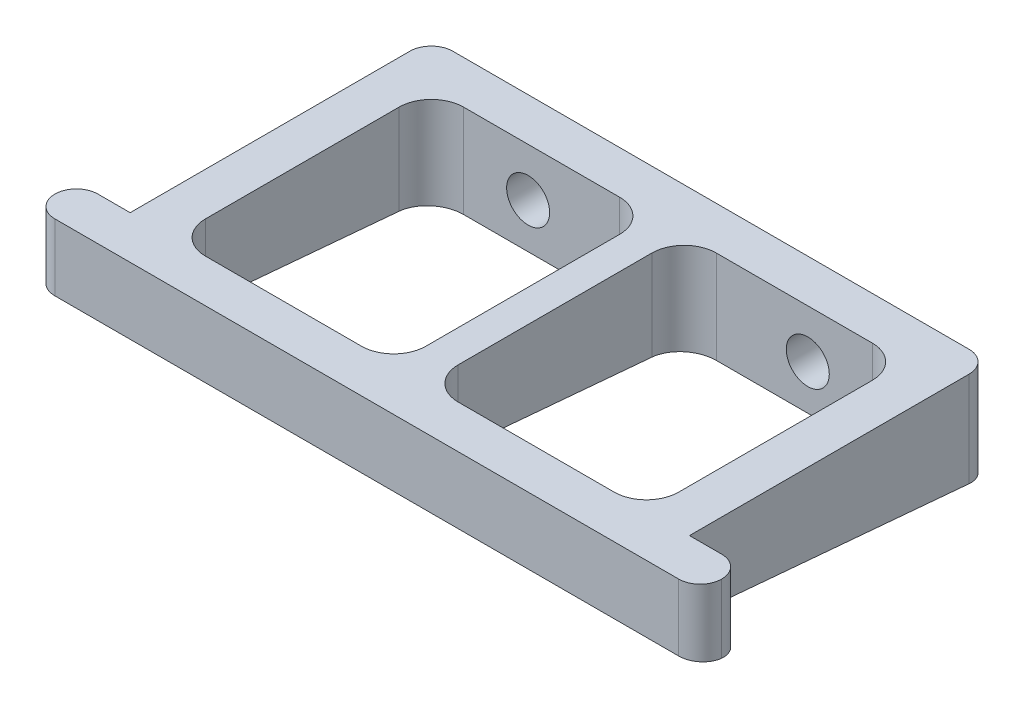
ISO-10303-21;
HEADER;
FILE_DESCRIPTION(('STEP AP214'),'2;1');
FILE_NAME('part.step','',(''),(''),'','','');
FILE_SCHEMA(('AUTOMOTIVE_DESIGN { 1 0 10303 214 1 1 1 1 }'));
ENDSEC;
DATA;
#1=APPLICATION_CONTEXT('core data for automotive mechanical design processes');
#2=APPLICATION_PROTOCOL_DEFINITION('international standard','automotive_design',2000,#1);
#3=PRODUCT_CONTEXT('',#1,'mechanical');
#4=PRODUCT('Part','Part','',(#3));
#5=PRODUCT_RELATED_PRODUCT_CATEGORY('part','',(#4));
#6=PRODUCT_DEFINITION_FORMATION('','',#4);
#7=PRODUCT_DEFINITION_CONTEXT('part definition',#1,'design');
#8=PRODUCT_DEFINITION('design','',#6,#7);
#9=PRODUCT_DEFINITION_SHAPE('','',#8);
#10=(LENGTH_UNIT() NAMED_UNIT(*) SI_UNIT(.MILLI.,.METRE.));
#11=(NAMED_UNIT(*) PLANE_ANGLE_UNIT() SI_UNIT($,.RADIAN.));
#12=(NAMED_UNIT(*) SI_UNIT($,.STERADIAN.) SOLID_ANGLE_UNIT());
#13=UNCERTAINTY_MEASURE_WITH_UNIT(LENGTH_MEASURE(1.E-05),#10,'distance_accuracy_value','');
#14=(GEOMETRIC_REPRESENTATION_CONTEXT(3) GLOBAL_UNCERTAINTY_ASSIGNED_CONTEXT((#13)) GLOBAL_UNIT_ASSIGNED_CONTEXT((#10,
#11,#12)) REPRESENTATION_CONTEXT('',''));
#15=CARTESIAN_POINT('',(0.,0.,0.));
#16=DIRECTION('',(0.,0.,1.));
#17=DIRECTION('',(1.,0.,0.));
#18=AXIS2_PLACEMENT_3D('',#15,#16,#17);
#19=CARTESIAN_POINT('',(0.,9.,0.));
#20=DIRECTION('',(0.,1.,0.));
#21=DIRECTION('',(0.,0.,1.));
#22=AXIS2_PLACEMENT_3D('',#19,#20,#21);
#23=PLANE('',#22);
#24=DIRECTION('',(-1.,0.,0.));
#25=VECTOR('',#24,1.);
#26=CARTESIAN_POINT('',(-26.,9.,-16.));
#27=LINE('',#26,#25);
#28=CARTESIAN_POINT('',(24.,9.,-16.));
#29=VERTEX_POINT('',#28);
#30=CARTESIAN_POINT('',(-24.,9.,-16.));
#31=VERTEX_POINT('',#30);
#32=EDGE_CURVE('E242',#29,#31,#27,.T.);
#33=ORIENTED_EDGE('',*,*,#32,.T.);
#34=CARTESIAN_POINT('',(-24.,9.,-14.));
#35=DIRECTION('',(0.,1.,0.));
#36=DIRECTION('',(0.,0.,1.));
#37=AXIS2_PLACEMENT_3D('',#34,#35,#36);
#38=CIRCLE('',#37,2.);
#39=CARTESIAN_POINT('',(-26.,9.,-14.));
#40=VERTEX_POINT('',#39);
#41=EDGE_CURVE('E232',#31,#40,#38,.T.);
#42=ORIENTED_EDGE('',*,*,#41,.T.);
#43=DIRECTION('',(0.,0.,1.));
#44=VECTOR('',#43,1.);
#45=CARTESIAN_POINT('',(-26.,9.,-16.));
#46=LINE('',#45,#44);
#47=CARTESIAN_POINT('',(-26.,9.,12.));
#48=VERTEX_POINT('',#47);
#49=EDGE_CURVE('E471',#40,#48,#46,.T.);
#50=ORIENTED_EDGE('',*,*,#49,.T.);
#51=DIRECTION('',(-1.,0.,0.));
#52=VECTOR('',#51,1.);
#53=CARTESIAN_POINT('',(-31.,9.,12.));
#54=LINE('',#53,#52);
#55=CARTESIAN_POINT('',(-29.,9.,12.));
#56=VERTEX_POINT('',#55);
#57=EDGE_CURVE('E420',#48,#56,#54,.T.);
#58=ORIENTED_EDGE('',*,*,#57,.T.);
#59=CARTESIAN_POINT('',(-29.,9.,14.));
#60=DIRECTION('',(0.,1.,0.));
#61=DIRECTION('',(0.,0.,1.));
#62=AXIS2_PLACEMENT_3D('',#59,#60,#61);
#63=CIRCLE('',#62,2.);
#64=CARTESIAN_POINT('',(-31.,9.,14.));
#65=VERTEX_POINT('',#64);
#66=EDGE_CURVE('E54',#56,#65,#63,.T.);
#67=ORIENTED_EDGE('',*,*,#66,.T.);
#68=CARTESIAN_POINT('',(-29.,9.,14.));
#69=DIRECTION('',(0.,1.,0.));
#70=DIRECTION('',(0.,0.,1.));
#71=AXIS2_PLACEMENT_3D('',#68,#69,#70);
#72=CIRCLE('',#71,2.);
#73=CARTESIAN_POINT('',(-29.,9.,16.));
#74=VERTEX_POINT('',#73);
#75=EDGE_CURVE('E395',#65,#74,#72,.T.);
#76=ORIENTED_EDGE('',*,*,#75,.T.);
#77=DIRECTION('',(1.,0.,0.));
#78=VECTOR('',#77,1.);
#79=CARTESIAN_POINT('',(26.,9.,16.));
#80=LINE('',#79,#78);
#81=CARTESIAN_POINT('',(29.,9.,16.));
#82=VERTEX_POINT('',#81);
#83=EDGE_CURVE('E310',#74,#82,#80,.T.);
#84=ORIENTED_EDGE('',*,*,#83,.T.);
#85=CARTESIAN_POINT('',(29.,9.,14.));
#86=DIRECTION('',(0.,1.,0.));
#87=DIRECTION('',(0.,0.,1.));
#88=AXIS2_PLACEMENT_3D('',#85,#86,#87);
#89=CIRCLE('',#88,2.);
#90=CARTESIAN_POINT('',(31.,9.,14.));
#91=VERTEX_POINT('',#90);
#92=EDGE_CURVE('E248',#82,#91,#89,.T.);
#93=ORIENTED_EDGE('',*,*,#92,.T.);
#94=CARTESIAN_POINT('',(29.,9.,14.));
#95=DIRECTION('',(0.,1.,0.));
#96=DIRECTION('',(0.,0.,1.));
#97=AXIS2_PLACEMENT_3D('',#94,#95,#96);
#98=CIRCLE('',#97,2.);
#99=CARTESIAN_POINT('',(29.,9.,12.));
#100=VERTEX_POINT('',#99);
#101=EDGE_CURVE('E251',#91,#100,#98,.T.);
#102=ORIENTED_EDGE('',*,*,#101,.T.);
#103=DIRECTION('',(-1.,0.,0.));
#104=VECTOR('',#103,1.);
#105=CARTESIAN_POINT('',(31.,9.,12.));
#106=LINE('',#105,#104);
#107=CARTESIAN_POINT('',(26.,9.,12.));
#108=VERTEX_POINT('',#107);
#109=EDGE_CURVE('E240',#100,#108,#106,.T.);
#110=ORIENTED_EDGE('',*,*,#109,.T.);
#111=DIRECTION('',(0.,0.,-1.));
#112=VECTOR('',#111,1.);
#113=CARTESIAN_POINT('',(26.,9.,-16.));
#114=LINE('',#113,#112);
#115=CARTESIAN_POINT('',(26.,9.,-14.));
#116=VERTEX_POINT('',#115);
#117=EDGE_CURVE('E226',#108,#116,#114,.T.);
#118=ORIENTED_EDGE('',*,*,#117,.T.);
#119=CARTESIAN_POINT('',(24.,9.,-14.));
#120=DIRECTION('',(0.,1.,0.));
#121=DIRECTION('',(0.,0.,1.));
#122=AXIS2_PLACEMENT_3D('',#119,#120,#121);
#123=CIRCLE('',#122,2.);
#124=EDGE_CURVE('E237',#116,#29,#123,.T.);
#125=ORIENTED_EDGE('',*,*,#124,.T.);
#126=EDGE_LOOP('',(#33,#42,#50,#58,#67,#76,#84,#93,#102,#110,#118,#125));
#127=FACE_BOUND('',#126,.T.);
#128=DIRECTION('',(-1.,0.,0.));
#129=VECTOR('',#128,1.);
#130=CARTESIAN_POINT('',(-22.,9.,-12.));
#131=LINE('',#130,#129);
#132=CARTESIAN_POINT('',(-4.5,9.,-12.));
#133=VERTEX_POINT('',#132);
#134=CARTESIAN_POINT('',(-19.,9.,-12.));
#135=VERTEX_POINT('',#134);
#136=EDGE_CURVE('E461',#133,#135,#131,.T.);
#137=ORIENTED_EDGE('',*,*,#136,.F.);
#138=CARTESIAN_POINT('',(-4.5,9.,-9.));
#139=DIRECTION('',(0.,1.,0.));
#140=DIRECTION('',(0.,0.,1.));
#141=AXIS2_PLACEMENT_3D('',#138,#139,#140);
#142=CIRCLE('',#141,3.);
#143=CARTESIAN_POINT('',(-1.5,9.,-9.));
#144=VERTEX_POINT('',#143);
#145=EDGE_CURVE('E289',#133,#144,#142,.F.);
#146=ORIENTED_EDGE('',*,*,#145,.T.);
#147=DIRECTION('',(0.,0.,-1.));
#148=VECTOR('',#147,1.);
#149=CARTESIAN_POINT('',(-1.5,9.,-12.));
#150=LINE('',#149,#148);
#151=CARTESIAN_POINT('',(-1.5,9.,9.));
#152=VERTEX_POINT('',#151);
#153=EDGE_CURVE('E271',#152,#144,#150,.T.);
#154=ORIENTED_EDGE('',*,*,#153,.F.);
#155=CARTESIAN_POINT('',(-4.5,9.,9.));
#156=DIRECTION('',(0.,1.,0.));
#157=DIRECTION('',(0.,0.,1.));
#158=AXIS2_PLACEMENT_3D('',#155,#156,#157);
#159=CIRCLE('',#158,3.);
#160=CARTESIAN_POINT('',(-4.5,9.,12.));
#161=VERTEX_POINT('',#160);
#162=EDGE_CURVE('E276',#152,#161,#159,.F.);
#163=ORIENTED_EDGE('',*,*,#162,.T.);
#164=DIRECTION('',(1.,0.,0.));
#165=VECTOR('',#164,1.);
#166=CARTESIAN_POINT('',(-22.,9.,12.));
#167=LINE('',#166,#165);
#168=CARTESIAN_POINT('',(-19.,9.,12.));
#169=VERTEX_POINT('',#168);
#170=EDGE_CURVE('E317',#169,#161,#167,.T.);
#171=ORIENTED_EDGE('',*,*,#170,.F.);
#172=CARTESIAN_POINT('',(-19.,9.,9.));
#173=DIRECTION('',(0.,1.,0.));
#174=DIRECTION('',(0.,0.,1.));
#175=AXIS2_PLACEMENT_3D('',#172,#173,#174);
#176=CIRCLE('',#175,3.);
#177=CARTESIAN_POINT('',(-22.,9.,9.));
#178=VERTEX_POINT('',#177);
#179=EDGE_CURVE('E275',#169,#178,#176,.F.);
#180=ORIENTED_EDGE('',*,*,#179,.T.);
#181=DIRECTION('',(0.,0.,1.));
#182=VECTOR('',#181,1.);
#183=CARTESIAN_POINT('',(-22.,9.,-12.));
#184=LINE('',#183,#182);
#185=CARTESIAN_POINT('',(-22.,9.,-9.));
#186=VERTEX_POINT('',#185);
#187=EDGE_CURVE('E464',#186,#178,#184,.T.);
#188=ORIENTED_EDGE('',*,*,#187,.F.);
#189=CARTESIAN_POINT('',(-19.,9.,-9.));
#190=DIRECTION('',(0.,1.,0.));
#191=DIRECTION('',(0.,0.,1.));
#192=AXIS2_PLACEMENT_3D('',#189,#190,#191);
#193=CIRCLE('',#192,3.);
#194=EDGE_CURVE('E282',#186,#135,#193,.F.);
#195=ORIENTED_EDGE('',*,*,#194,.T.);
#196=EDGE_LOOP('',(#137,#146,#154,#163,#171,#180,#188,#195));
#197=FACE_BOUND('',#196,.T.);
#198=DIRECTION('',(-1.,0.,0.));
#199=VECTOR('',#198,1.);
#200=CARTESIAN_POINT('',(22.,9.,-12.));
#201=LINE('',#200,#199);
#202=CARTESIAN_POINT('',(19.,9.,-12.));
#203=VERTEX_POINT('',#202);
#204=CARTESIAN_POINT('',(4.5,9.,-12.));
#205=VERTEX_POINT('',#204);
#206=EDGE_CURVE('E452',#203,#205,#201,.T.);
#207=ORIENTED_EDGE('',*,*,#206,.F.);
#208=CARTESIAN_POINT('',(19.,9.,-9.00000000000001));
#209=DIRECTION('',(0.,1.,0.));
#210=DIRECTION('',(0.,0.,1.));
#211=AXIS2_PLACEMENT_3D('',#208,#209,#210);
#212=CIRCLE('',#211,3.);
#213=CARTESIAN_POINT('',(22.,9.,-9.00000000000001));
#214=VERTEX_POINT('',#213);
#215=EDGE_CURVE('E335',#203,#214,#212,.F.);
#216=ORIENTED_EDGE('',*,*,#215,.T.);
#217=DIRECTION('',(0.,0.,-1.));
#218=VECTOR('',#217,1.);
#219=CARTESIAN_POINT('',(22.,9.,-12.));
#220=LINE('',#219,#218);
#221=CARTESIAN_POINT('',(22.,9.,8.99999999999999));
#222=VERTEX_POINT('',#221);
#223=EDGE_CURVE('E324',#222,#214,#220,.T.);
#224=ORIENTED_EDGE('',*,*,#223,.F.);
#225=CARTESIAN_POINT('',(19.,9.,8.99999999999999));
#226=DIRECTION('',(0.,1.,0.));
#227=DIRECTION('',(0.,0.,1.));
#228=AXIS2_PLACEMENT_3D('',#225,#226,#227);
#229=CIRCLE('',#228,3.);
#230=CARTESIAN_POINT('',(19.,9.,12.));
#231=VERTEX_POINT('',#230);
#232=EDGE_CURVE('E166',#222,#231,#229,.F.);
#233=ORIENTED_EDGE('',*,*,#232,.T.);
#234=DIRECTION('',(1.,0.,0.));
#235=VECTOR('',#234,1.);
#236=CARTESIAN_POINT('',(22.,9.,12.));
#237=LINE('',#236,#235);
#238=CARTESIAN_POINT('',(4.50000000000001,9.,12.));
#239=VERTEX_POINT('',#238);
#240=EDGE_CURVE('E292',#239,#231,#237,.T.);
#241=ORIENTED_EDGE('',*,*,#240,.F.);
#242=CARTESIAN_POINT('',(4.50000000000001,9.,9.));
#243=DIRECTION('',(0.,1.,0.));
#244=DIRECTION('',(0.,0.,1.));
#245=AXIS2_PLACEMENT_3D('',#242,#243,#244);
#246=CIRCLE('',#245,3.);
#247=CARTESIAN_POINT('',(1.50000000000001,9.,9.));
#248=VERTEX_POINT('',#247);
#249=EDGE_CURVE('E328',#239,#248,#246,.F.);
#250=ORIENTED_EDGE('',*,*,#249,.T.);
#251=DIRECTION('',(0.,0.,1.));
#252=VECTOR('',#251,1.);
#253=CARTESIAN_POINT('',(1.5,9.,-12.));
#254=LINE('',#253,#252);
#255=CARTESIAN_POINT('',(1.5,9.,-9.));
#256=VERTEX_POINT('',#255);
#257=EDGE_CURVE('E436',#256,#248,#254,.T.);
#258=ORIENTED_EDGE('',*,*,#257,.F.);
#259=CARTESIAN_POINT('',(4.5,9.,-9.));
#260=DIRECTION('',(0.,1.,0.));
#261=DIRECTION('',(0.,0.,1.));
#262=AXIS2_PLACEMENT_3D('',#259,#260,#261);
#263=CIRCLE('',#262,3.);
#264=EDGE_CURVE('E283',#256,#205,#263,.F.);
#265=ORIENTED_EDGE('',*,*,#264,.T.);
#266=EDGE_LOOP('',(#207,#216,#224,#233,#241,#250,#258,#265));
#267=FACE_BOUND('',#266,.T.);
#268=ADVANCED_FACE('F35',(#127,#197,#267),#23,.T.);
#269=CARTESIAN_POINT('',(-26.,0.,-16.));
#270=DIRECTION('',(0.,-0.996194698091745,0.0871557427476582));
#271=DIRECTION('',(0.,-0.0871557427476582,-0.996194698091746));
#272=AXIS2_PLACEMENT_3D('',#269,#270,#271);
#273=PLANE('',#272);
#274=DIRECTION('',(-1.,0.,0.));
#275=VECTOR('',#274,1.);
#276=CARTESIAN_POINT('',(-22.,2.44968257872587,12.));
#277=LINE('',#276,#275);
#278=CARTESIAN_POINT('',(-19.,2.44968257872587,12.));
#279=VERTEX_POINT('',#278);
#280=CARTESIAN_POINT('',(-4.5,2.44968257872587,12.));
#281=VERTEX_POINT('',#280);
#282=EDGE_CURVE('E268',#279,#281,#277,.F.);
#283=ORIENTED_EDGE('',*,*,#282,.T.);
#284=CARTESIAN_POINT('',(-4.5,2.1872165881481,9.));
#285=DIRECTION('',(0.,-0.996194698091745,0.0871557427476582));
#286=DIRECTION('',(0.,0.0871557427476582,0.996194698091746));
#287=AXIS2_PLACEMENT_3D('',#284,#285,#286);
#288=ELLIPSE('',#287,3.01145951263004,3.);
#289=CARTESIAN_POINT('',(-1.5,2.1872165881481,9.));
#290=VERTEX_POINT('',#289);
#291=EDGE_CURVE('E293',#281,#290,#288,.F.);
#292=ORIENTED_EDGE('',*,*,#291,.T.);
#293=DIRECTION('',(0.,0.0871557427476582,0.996194698091746));
#294=VECTOR('',#293,1.);
#295=CARTESIAN_POINT('',(-1.5,0.415661466778926,-11.2489676944744));
#296=LINE('',#295,#294);
#297=CARTESIAN_POINT('',(-1.5,0.612420644681469,-9.));
#298=VERTEX_POINT('',#297);
#299=EDGE_CURVE('E286',#290,#298,#296,.F.);
#300=ORIENTED_EDGE('',*,*,#299,.T.);
#301=CARTESIAN_POINT('',(-4.5,0.612420644681469,-9.));
#302=DIRECTION('',(0.,-0.996194698091745,0.0871557427476582));
#303=DIRECTION('',(0.,0.0871557427476582,0.996194698091746));
#304=AXIS2_PLACEMENT_3D('',#301,#302,#303);
#305=ELLIPSE('',#304,3.01145951263004,3.);
#306=CARTESIAN_POINT('',(-4.5,0.349954654103698,-12.));
#307=VERTEX_POINT('',#306);
#308=EDGE_CURVE('E287',#298,#307,#305,.F.);
#309=ORIENTED_EDGE('',*,*,#308,.T.);
#310=DIRECTION('',(1.,0.,0.));
#311=VECTOR('',#310,1.);
#312=CARTESIAN_POINT('',(-22.,0.349954654103698,-12.));
#313=LINE('',#312,#311);
#314=CARTESIAN_POINT('',(-19.,0.349954654103696,-12.));
#315=VERTEX_POINT('',#314);
#316=EDGE_CURVE('E279',#307,#315,#313,.F.);
#317=ORIENTED_EDGE('',*,*,#316,.T.);
#318=CARTESIAN_POINT('',(-19.,0.612420644681469,-9.));
#319=DIRECTION('',(0.,-0.996194698091745,0.0871557427476582));
#320=DIRECTION('',(0.,0.0871557427476582,0.996194698091746));
#321=AXIS2_PLACEMENT_3D('',#318,#319,#320);
#322=ELLIPSE('',#321,3.01145951263004,3.);
#323=CARTESIAN_POINT('',(-22.,0.612420644681469,-9.));
#324=VERTEX_POINT('',#323);
#325=EDGE_CURVE('E280',#315,#324,#322,.F.);
#326=ORIENTED_EDGE('',*,*,#325,.T.);
#327=DIRECTION('',(0.,-0.0871557427476582,-0.996194698091746));
#328=VECTOR('',#327,1.);
#329=CARTESIAN_POINT('',(-22.,0.415661466778926,-11.2489676944744));
#330=LINE('',#329,#328);
#331=CARTESIAN_POINT('',(-22.,2.1872165881481,9.));
#332=VERTEX_POINT('',#331);
#333=EDGE_CURVE('E272',#324,#332,#330,.F.);
#334=ORIENTED_EDGE('',*,*,#333,.T.);
#335=CARTESIAN_POINT('',(-19.,2.1872165881481,9.));
#336=DIRECTION('',(0.,-0.996194698091745,0.0871557427476582));
#337=DIRECTION('',(0.,0.0871557427476582,0.996194698091746));
#338=AXIS2_PLACEMENT_3D('',#335,#336,#337);
#339=ELLIPSE('',#338,3.01145951263004,3.);
#340=EDGE_CURVE('E273',#332,#279,#339,.F.);
#341=ORIENTED_EDGE('',*,*,#340,.T.);
#342=EDGE_LOOP('',(#283,#292,#300,#309,#317,#326,#334,#341));
#343=FACE_BOUND('',#342,.T.);
#344=DIRECTION('',(0.,-0.0871557427476582,-0.996194698091746));
#345=VECTOR('',#344,1.);
#346=CARTESIAN_POINT('',(-26.,0.068365111445064,-15.2185832004988));
#347=LINE('',#346,#345);
#348=CARTESIAN_POINT('',(-26.,0.174977327051847,-14.));
#349=VERTEX_POINT('',#348);
#350=CARTESIAN_POINT('',(-26.,2.44968257872587,12.));
#351=VERTEX_POINT('',#350);
#352=EDGE_CURVE('E295',#349,#351,#347,.F.);
#353=ORIENTED_EDGE('',*,*,#352,.F.);
#354=CARTESIAN_POINT('',(-24.,0.174977327051847,-14.));
#355=DIRECTION('',(0.,-0.996194698091745,0.0871557427476582));
#356=DIRECTION('',(0.,-0.0871557427476582,-0.996194698091746));
#357=AXIS2_PLACEMENT_3D('',#354,#355,#356);
#358=ELLIPSE('',#357,2.0076396750867,2.);
#359=CARTESIAN_POINT('',(-24.,0.,-16.));
#360=VERTEX_POINT('',#359);
#361=EDGE_CURVE('E320',#349,#360,#358,.T.);
#362=ORIENTED_EDGE('',*,*,#361,.T.);
#363=DIRECTION('',(-1.,0.,0.));
#364=VECTOR('',#363,1.);
#365=CARTESIAN_POINT('',(-26.,0.,-16.));
#366=LINE('',#365,#364);
#367=CARTESIAN_POINT('',(24.,0.,-16.));
#368=VERTEX_POINT('',#367);
#369=EDGE_CURVE('E298',#368,#360,#366,.T.);
#370=ORIENTED_EDGE('',*,*,#369,.F.);
#371=CARTESIAN_POINT('',(24.,0.174977327051847,-14.));
#372=DIRECTION('',(0.,-0.996194698091745,0.0871557427476582));
#373=DIRECTION('',(0.,-0.0871557427476582,-0.996194698091746));
#374=AXIS2_PLACEMENT_3D('',#371,#372,#373);
#375=ELLIPSE('',#374,2.0076396750867,2.);
#376=CARTESIAN_POINT('',(26.,0.174977327051847,-14.));
#377=VERTEX_POINT('',#376);
#378=EDGE_CURVE('E313',#368,#377,#375,.T.);
#379=ORIENTED_EDGE('',*,*,#378,.T.);
#380=DIRECTION('',(0.,0.0871557427476582,0.996194698091746));
#381=VECTOR('',#380,1.);
#382=CARTESIAN_POINT('',(26.,0.068365111445064,-15.2185832004988));
#383=LINE('',#382,#381);
#384=CARTESIAN_POINT('',(26.,2.44968257872587,12.));
#385=VERTEX_POINT('',#384);
#386=EDGE_CURVE('E228',#385,#377,#383,.F.);
#387=ORIENTED_EDGE('',*,*,#386,.F.);
#388=DIRECTION('',(1.,0.,0.));
#389=VECTOR('',#388,1.);
#390=CARTESIAN_POINT('',(31.,2.44968257872587,12.));
#391=LINE('',#390,#389);
#392=CARTESIAN_POINT('',(29.,2.44968257872587,12.));
#393=VERTEX_POINT('',#392);
#394=EDGE_CURVE('E315',#393,#385,#391,.F.);
#395=ORIENTED_EDGE('',*,*,#394,.F.);
#396=CARTESIAN_POINT('',(29.,2.62465990577772,14.));
#397=DIRECTION('',(0.,-0.996194698091745,0.0871557427476582));
#398=DIRECTION('',(0.,-0.0871557427476582,-0.996194698091746));
#399=AXIS2_PLACEMENT_3D('',#396,#397,#398);
#400=ELLIPSE('',#399,2.0076396750867,2.);
#401=CARTESIAN_POINT('',(31.,2.62465990577772,14.));
#402=VERTEX_POINT('',#401);
#403=EDGE_CURVE('E304',#393,#402,#400,.T.);
#404=ORIENTED_EDGE('',*,*,#403,.T.);
#405=CARTESIAN_POINT('',(29.,2.62465990577772,14.));
#406=DIRECTION('',(0.,-0.996194698091745,0.0871557427476582));
#407=DIRECTION('',(0.,-0.0871557427476582,-0.996194698091746));
#408=AXIS2_PLACEMENT_3D('',#405,#406,#407);
#409=ELLIPSE('',#408,2.0076396750867,2.);
#410=CARTESIAN_POINT('',(29.,2.79963723282957,16.));
#411=VERTEX_POINT('',#410);
#412=EDGE_CURVE('E311',#402,#411,#409,.T.);
#413=ORIENTED_EDGE('',*,*,#412,.T.);
#414=DIRECTION('',(-1.,0.,0.));
#415=VECTOR('',#414,1.);
#416=CARTESIAN_POINT('',(-26.,2.79963723282957,16.));
#417=LINE('',#416,#415);
#418=CARTESIAN_POINT('',(-29.,2.79963723282957,16.));
#419=VERTEX_POINT('',#418);
#420=EDGE_CURVE('E301',#419,#411,#417,.F.);
#421=ORIENTED_EDGE('',*,*,#420,.F.);
#422=CARTESIAN_POINT('',(-29.,2.62465990577772,14.));
#423=DIRECTION('',(0.,-0.996194698091745,0.0871557427476582));
#424=DIRECTION('',(0.,-0.0871557427476582,-0.996194698091746));
#425=AXIS2_PLACEMENT_3D('',#422,#423,#424);
#426=ELLIPSE('',#425,2.0076396750867,2.);
#427=CARTESIAN_POINT('',(-31.,2.62465990577772,14.));
#428=VERTEX_POINT('',#427);
#429=EDGE_CURVE('E305',#419,#428,#426,.T.);
#430=ORIENTED_EDGE('',*,*,#429,.T.);
#431=CARTESIAN_POINT('',(-29.,2.62465990577772,14.));
#432=DIRECTION('',(0.,-0.996194698091745,0.0871557427476582));
#433=DIRECTION('',(0.,-0.0871557427476582,-0.996194698091746));
#434=AXIS2_PLACEMENT_3D('',#431,#432,#433);
#435=ELLIPSE('',#434,2.0076396750867,2.);
#436=CARTESIAN_POINT('',(-29.,2.44968257872587,12.));
#437=VERTEX_POINT('',#436);
#438=EDGE_CURVE('E302',#428,#437,#435,.T.);
#439=ORIENTED_EDGE('',*,*,#438,.T.);
#440=DIRECTION('',(1.,0.,0.));
#441=VECTOR('',#440,1.);
#442=CARTESIAN_POINT('',(-31.,2.44968257872587,12.));
#443=LINE('',#442,#441);
#444=EDGE_CURVE('E297',#351,#437,#443,.F.);
#445=ORIENTED_EDGE('',*,*,#444,.F.);
#446=EDGE_LOOP('',(#353,#362,#370,#379,#387,#395,#404,#413,#421,#430,#439,#445));
#447=FACE_BOUND('',#446,.T.);
#448=DIRECTION('',(-1.,0.,0.));
#449=VECTOR('',#448,1.);
#450=CARTESIAN_POINT('',(22.,2.44968257872587,12.));
#451=LINE('',#450,#449);
#452=CARTESIAN_POINT('',(4.50000000000001,2.44968257872587,12.));
#453=VERTEX_POINT('',#452);
#454=CARTESIAN_POINT('',(19.,2.44968257872587,12.));
#455=VERTEX_POINT('',#454);
#456=EDGE_CURVE('E322',#453,#455,#451,.F.);
#457=ORIENTED_EDGE('',*,*,#456,.T.);
#458=CARTESIAN_POINT('',(19.,2.1872165881481,8.99999999999999));
#459=DIRECTION('',(0.,-0.996194698091745,0.0871557427476582));
#460=DIRECTION('',(0.,0.0871557427476582,0.996194698091746));
#461=AXIS2_PLACEMENT_3D('',#458,#459,#460);
#462=ELLIPSE('',#461,3.01145951263004,3.);
#463=CARTESIAN_POINT('',(22.,2.1872165881481,8.99999999999999));
#464=VERTEX_POINT('',#463);
#465=EDGE_CURVE('E39',#455,#464,#462,.F.);
#466=ORIENTED_EDGE('',*,*,#465,.T.);
#467=DIRECTION('',(0.,0.0871557427476582,0.996194698091746));
#468=VECTOR('',#467,1.);
#469=CARTESIAN_POINT('',(22.,0.415661466778926,-11.2489676944744));
#470=LINE('',#469,#468);
#471=CARTESIAN_POINT('',(22.,0.612420644681468,-9.00000000000001));
#472=VERTEX_POINT('',#471);
#473=EDGE_CURVE('E263',#464,#472,#470,.F.);
#474=ORIENTED_EDGE('',*,*,#473,.T.);
#475=CARTESIAN_POINT('',(19.,0.612420644681469,-9.00000000000001));
#476=DIRECTION('',(0.,-0.996194698091745,0.0871557427476582));
#477=DIRECTION('',(0.,0.0871557427476582,0.996194698091746));
#478=AXIS2_PLACEMENT_3D('',#475,#476,#477);
#479=ELLIPSE('',#478,3.01145951263004,3.);
#480=CARTESIAN_POINT('',(19.,0.349954654103698,-12.));
#481=VERTEX_POINT('',#480);
#482=EDGE_CURVE('E338',#472,#481,#479,.F.);
#483=ORIENTED_EDGE('',*,*,#482,.T.);
#484=DIRECTION('',(1.,0.,0.));
#485=VECTOR('',#484,1.);
#486=CARTESIAN_POINT('',(22.,0.349954654103698,-12.));
#487=LINE('',#486,#485);
#488=CARTESIAN_POINT('',(4.5,0.349954654103696,-12.));
#489=VERTEX_POINT('',#488);
#490=EDGE_CURVE('E332',#481,#489,#487,.F.);
#491=ORIENTED_EDGE('',*,*,#490,.T.);
#492=CARTESIAN_POINT('',(4.5,0.612420644681469,-9.));
#493=DIRECTION('',(0.,-0.996194698091745,0.0871557427476582));
#494=DIRECTION('',(0.,0.0871557427476582,0.996194698091746));
#495=AXIS2_PLACEMENT_3D('',#492,#493,#494);
#496=ELLIPSE('',#495,3.01145951263004,3.);
#497=CARTESIAN_POINT('',(1.5,0.612420644681469,-9.));
#498=VERTEX_POINT('',#497);
#499=EDGE_CURVE('E333',#489,#498,#496,.F.);
#500=ORIENTED_EDGE('',*,*,#499,.T.);
#501=DIRECTION('',(0.,-0.0871557427476582,-0.996194698091746));
#502=VECTOR('',#501,1.);
#503=CARTESIAN_POINT('',(1.5,0.415661466778926,-11.2489676944744));
#504=LINE('',#503,#502);
#505=CARTESIAN_POINT('',(1.50000000000001,2.1872165881481,9.));
#506=VERTEX_POINT('',#505);
#507=EDGE_CURVE('E325',#498,#506,#504,.F.);
#508=ORIENTED_EDGE('',*,*,#507,.T.);
#509=CARTESIAN_POINT('',(4.50000000000001,2.1872165881481,9.));
#510=DIRECTION('',(0.,-0.996194698091745,0.0871557427476582));
#511=DIRECTION('',(0.,0.0871557427476582,0.996194698091746));
#512=AXIS2_PLACEMENT_3D('',#509,#510,#511);
#513=ELLIPSE('',#512,3.01145951263004,3.);
#514=EDGE_CURVE('E326',#506,#453,#513,.F.);
#515=ORIENTED_EDGE('',*,*,#514,.T.);
#516=EDGE_LOOP('',(#457,#466,#474,#483,#491,#500,#508,#515));
#517=FACE_BOUND('',#516,.T.);
#518=ADVANCED_FACE('F37',(#343,#447,#517),#273,.T.);
#519=CARTESIAN_POINT('',(31.,9.,12.));
#520=DIRECTION('',(0.,0.,1.));
#521=DIRECTION('',(1.,0.,0.));
#522=AXIS2_PLACEMENT_3D('',#519,#520,#521);
#523=PLANE('',#522);
#524=ORIENTED_EDGE('',*,*,#109,.F.);
#525=DIRECTION('',(0.,-1.,0.));
#526=VECTOR('',#525,1.);
#527=CARTESIAN_POINT('',(29.,9.,12.));
#528=LINE('',#527,#526);
#529=EDGE_CURVE('E45',#100,#393,#528,.T.);
#530=ORIENTED_EDGE('',*,*,#529,.T.);
#531=ORIENTED_EDGE('',*,*,#394,.T.);
#532=DIRECTION('',(0.,-1.,0.));
#533=VECTOR('',#532,1.);
#534=CARTESIAN_POINT('',(26.,9.,12.));
#535=LINE('',#534,#533);
#536=EDGE_CURVE('E405',#108,#385,#535,.T.);
#537=ORIENTED_EDGE('',*,*,#536,.F.);
#538=EDGE_LOOP('',(#524,#530,#531,#537));
#539=FACE_BOUND('',#538,.T.);
#540=ADVANCED_FACE('F403',(#539),#523,.F.);
#541=CARTESIAN_POINT('',(26.,9.,-16.));
#542=DIRECTION('',(-1.,0.,0.));
#543=DIRECTION('',(0.,0.,1.));
#544=AXIS2_PLACEMENT_3D('',#541,#542,#543);
#545=PLANE('',#544);
#546=ORIENTED_EDGE('',*,*,#386,.T.);
#547=DIRECTION('',(0.,-1.,0.));
#548=VECTOR('',#547,1.);
#549=CARTESIAN_POINT('',(26.,9.,-14.));
#550=LINE('',#549,#548);
#551=EDGE_CURVE('E222',#377,#116,#550,.F.);
#552=ORIENTED_EDGE('',*,*,#551,.T.);
#553=ORIENTED_EDGE('',*,*,#117,.F.);
#554=ORIENTED_EDGE('',*,*,#536,.T.);
#555=EDGE_LOOP('',(#546,#552,#553,#554));
#556=FACE_BOUND('',#555,.T.);
#557=ADVANCED_FACE('F224',(#556),#545,.F.);
#558=CARTESIAN_POINT('',(-26.,9.,-16.));
#559=DIRECTION('',(0.,0.,1.));
#560=DIRECTION('',(1.,0.,0.));
#561=AXIS2_PLACEMENT_3D('',#558,#559,#560);
#562=PLANE('',#561);
#563=CARTESIAN_POINT('',(-13.,4.49999999999999,-16.));
#564=DIRECTION('',(0.,0.,-1.));
#565=DIRECTION('',(1.,0.,0.));
#566=AXIS2_PLACEMENT_3D('',#563,#564,#565);
#567=CIRCLE('',#566,2.);
#568=CARTESIAN_POINT('',(-11.,4.49999999999999,-16.));
#569=VERTEX_POINT('',#568);
#570=EDGE_CURVE('E782',#569,#569,#567,.T.);
#571=ORIENTED_EDGE('',*,*,#570,.F.);
#572=EDGE_LOOP('',(#571));
#573=FACE_BOUND('',#572,.T.);
#574=CARTESIAN_POINT('',(13.,4.5,-16.));
#575=DIRECTION('',(0.,0.,-1.));
#576=DIRECTION('',(-1.,0.,0.));
#577=AXIS2_PLACEMENT_3D('',#574,#575,#576);
#578=CIRCLE('',#577,2.);
#579=CARTESIAN_POINT('',(11.,4.5,-16.));
#580=VERTEX_POINT('',#579);
#581=EDGE_CURVE('E267',#580,#580,#578,.T.);
#582=ORIENTED_EDGE('',*,*,#581,.F.);
#583=EDGE_LOOP('',(#582));
#584=FACE_BOUND('',#583,.T.);
#585=ORIENTED_EDGE('',*,*,#369,.T.);
#586=DIRECTION('',(0.,-1.,0.));
#587=VECTOR('',#586,1.);
#588=CARTESIAN_POINT('',(-24.,9.,-16.));
#589=LINE('',#588,#587);
#590=EDGE_CURVE('E393',#360,#31,#589,.F.);
#591=ORIENTED_EDGE('',*,*,#590,.T.);
#592=ORIENTED_EDGE('',*,*,#32,.F.);
#593=DIRECTION('',(0.,-1.,0.));
#594=VECTOR('',#593,1.);
#595=CARTESIAN_POINT('',(24.,9.,-16.));
#596=LINE('',#595,#594);
#597=EDGE_CURVE('E247',#29,#368,#596,.T.);
#598=ORIENTED_EDGE('',*,*,#597,.T.);
#599=EDGE_LOOP('',(#585,#591,#592,#598));
#600=FACE_BOUND('',#599,.T.);
#601=ADVANCED_FACE('F478',(#573,#584,#600),#562,.F.);
#602=CARTESIAN_POINT('',(-26.,9.,-16.));
#603=DIRECTION('',(1.,0.,0.));
#604=DIRECTION('',(0.,0.,-1.));
#605=AXIS2_PLACEMENT_3D('',#602,#603,#604);
#606=PLANE('',#605);
#607=ORIENTED_EDGE('',*,*,#49,.F.);
#608=DIRECTION('',(0.,-1.,0.));
#609=VECTOR('',#608,1.);
#610=CARTESIAN_POINT('',(-26.,9.,-14.));
#611=LINE('',#610,#609);
#612=EDGE_CURVE('E307',#40,#349,#611,.T.);
#613=ORIENTED_EDGE('',*,*,#612,.T.);
#614=ORIENTED_EDGE('',*,*,#352,.T.);
#615=DIRECTION('',(0.,-1.,0.));
#616=VECTOR('',#615,1.);
#617=CARTESIAN_POINT('',(-26.,9.,12.));
#618=LINE('',#617,#616);
#619=EDGE_CURVE('E414',#48,#351,#618,.T.);
#620=ORIENTED_EDGE('',*,*,#619,.F.);
#621=EDGE_LOOP('',(#607,#613,#614,#620));
#622=FACE_BOUND('',#621,.T.);
#623=ADVANCED_FACE('F486',(#622),#606,.F.);
#624=CARTESIAN_POINT('',(-31.,9.,12.));
#625=DIRECTION('',(0.,0.,1.));
#626=DIRECTION('',(1.,0.,0.));
#627=AXIS2_PLACEMENT_3D('',#624,#625,#626);
#628=PLANE('',#627);
#629=ORIENTED_EDGE('',*,*,#444,.T.);
#630=DIRECTION('',(0.,-1.,0.));
#631=VECTOR('',#630,1.);
#632=CARTESIAN_POINT('',(-29.,9.,12.));
#633=LINE('',#632,#631);
#634=EDGE_CURVE('E11',#437,#56,#633,.F.);
#635=ORIENTED_EDGE('',*,*,#634,.T.);
#636=ORIENTED_EDGE('',*,*,#57,.F.);
#637=ORIENTED_EDGE('',*,*,#619,.T.);
#638=EDGE_LOOP('',(#629,#635,#636,#637));
#639=FACE_BOUND('',#638,.T.);
#640=ADVANCED_FACE('F491',(#639),#628,.F.);
#641=CARTESIAN_POINT('',(-26.,9.,16.));
#642=DIRECTION('',(0.,0.,-1.));
#643=DIRECTION('',(-1.,0.,0.));
#644=AXIS2_PLACEMENT_3D('',#641,#642,#643);
#645=PLANE('',#644);
#646=ORIENTED_EDGE('',*,*,#420,.T.);
#647=DIRECTION('',(0.,-1.,0.));
#648=VECTOR('',#647,1.);
#649=CARTESIAN_POINT('',(29.,9.,16.));
#650=LINE('',#649,#648);
#651=EDGE_CURVE('E256',#411,#82,#650,.F.);
#652=ORIENTED_EDGE('',*,*,#651,.T.);
#653=ORIENTED_EDGE('',*,*,#83,.F.);
#654=DIRECTION('',(0.,-1.,0.));
#655=VECTOR('',#654,1.);
#656=CARTESIAN_POINT('',(-29.,9.,16.));
#657=LINE('',#656,#655);
#658=EDGE_CURVE('E231',#74,#419,#657,.T.);
#659=ORIENTED_EDGE('',*,*,#658,.T.);
#660=EDGE_LOOP('',(#646,#652,#653,#659));
#661=FACE_BOUND('',#660,.T.);
#662=ADVANCED_FACE('F503',(#661),#645,.F.);
#663=CARTESIAN_POINT('',(-1.5,9.,-12.));
#664=DIRECTION('',(-1.,0.,0.));
#665=DIRECTION('',(0.,0.,1.));
#666=AXIS2_PLACEMENT_3D('',#663,#664,#665);
#667=PLANE('',#666);
#668=ORIENTED_EDGE('',*,*,#153,.T.);
#669=DIRECTION('',(0.,-1.,0.));
#670=VECTOR('',#669,1.);
#671=CARTESIAN_POINT('',(-1.5,0.,-9.));
#672=LINE('',#671,#670);
#673=EDGE_CURVE('E374',#144,#298,#672,.T.);
#674=ORIENTED_EDGE('',*,*,#673,.T.);
#675=ORIENTED_EDGE('',*,*,#299,.F.);
#676=DIRECTION('',(0.,-1.,0.));
#677=VECTOR('',#676,1.);
#678=CARTESIAN_POINT('',(-1.5,9.,9.));
#679=LINE('',#678,#677);
#680=EDGE_CURVE('E372',#290,#152,#679,.F.);
#681=ORIENTED_EDGE('',*,*,#680,.T.);
#682=EDGE_LOOP('',(#668,#674,#675,#681));
#683=FACE_BOUND('',#682,.T.);
#684=ADVANCED_FACE('F523',(#683),#667,.T.);
#685=CARTESIAN_POINT('',(-22.,9.,-12.));
#686=DIRECTION('',(0.,0.,1.));
#687=DIRECTION('',(1.,0.,0.));
#688=AXIS2_PLACEMENT_3D('',#685,#686,#687);
#689=PLANE('',#688);
#690=CARTESIAN_POINT('',(-13.,4.49999999999999,-12.));
#691=DIRECTION('',(0.,0.,1.));
#692=DIRECTION('',(1.,0.,0.));
#693=AXIS2_PLACEMENT_3D('',#690,#691,#692);
#694=CIRCLE('',#693,2.);
#695=CARTESIAN_POINT('',(-11.,4.49999999999999,-12.));
#696=VERTEX_POINT('',#695);
#697=EDGE_CURVE('E786',#696,#696,#694,.F.);
#698=ORIENTED_EDGE('',*,*,#697,.T.);
#699=EDGE_LOOP('',(#698));
#700=FACE_BOUND('',#699,.T.);
#701=ORIENTED_EDGE('',*,*,#136,.T.);
#702=DIRECTION('',(0.,-1.,0.));
#703=VECTOR('',#702,1.);
#704=CARTESIAN_POINT('',(-19.,0.,-12.));
#705=LINE('',#704,#703);
#706=EDGE_CURVE('E364',#135,#315,#705,.T.);
#707=ORIENTED_EDGE('',*,*,#706,.T.);
#708=ORIENTED_EDGE('',*,*,#316,.F.);
#709=DIRECTION('',(0.,-1.,0.));
#710=VECTOR('',#709,1.);
#711=CARTESIAN_POINT('',(-4.5,9.,-12.));
#712=LINE('',#711,#710);
#713=EDGE_CURVE('E362',#307,#133,#712,.F.);
#714=ORIENTED_EDGE('',*,*,#713,.T.);
#715=EDGE_LOOP('',(#701,#707,#708,#714));
#716=FACE_BOUND('',#715,.T.);
#717=ADVANCED_FACE('F660',(#700,#716),#689,.T.);
#718=CARTESIAN_POINT('',(-22.,9.,-12.));
#719=DIRECTION('',(1.,0.,0.));
#720=DIRECTION('',(0.,0.,-1.));
#721=AXIS2_PLACEMENT_3D('',#718,#719,#720);
#722=PLANE('',#721);
#723=ORIENTED_EDGE('',*,*,#333,.F.);
#724=DIRECTION('',(0.,-1.,0.));
#725=VECTOR('',#724,1.);
#726=CARTESIAN_POINT('',(-22.,9.,-9.));
#727=LINE('',#726,#725);
#728=EDGE_CURVE('E370',#324,#186,#727,.F.);
#729=ORIENTED_EDGE('',*,*,#728,.T.);
#730=ORIENTED_EDGE('',*,*,#187,.T.);
#731=DIRECTION('',(0.,-1.,0.));
#732=VECTOR('',#731,1.);
#733=CARTESIAN_POINT('',(-22.,0.,9.));
#734=LINE('',#733,#732);
#735=EDGE_CURVE('E367',#178,#332,#734,.T.);
#736=ORIENTED_EDGE('',*,*,#735,.T.);
#737=EDGE_LOOP('',(#723,#729,#730,#736));
#738=FACE_BOUND('',#737,.T.);
#739=ADVANCED_FACE('F669',(#738),#722,.T.);
#740=CARTESIAN_POINT('',(-22.,9.,12.));
#741=DIRECTION('',(0.,0.,-1.));
#742=DIRECTION('',(-1.,0.,0.));
#743=AXIS2_PLACEMENT_3D('',#740,#741,#742);
#744=PLANE('',#743);
#745=ORIENTED_EDGE('',*,*,#170,.T.);
#746=DIRECTION('',(0.,-1.,0.));
#747=VECTOR('',#746,1.);
#748=CARTESIAN_POINT('',(-4.5,0.,12.));
#749=LINE('',#748,#747);
#750=EDGE_CURVE('E329',#161,#281,#749,.T.);
#751=ORIENTED_EDGE('',*,*,#750,.T.);
#752=ORIENTED_EDGE('',*,*,#282,.F.);
#753=DIRECTION('',(0.,-1.,0.));
#754=VECTOR('',#753,1.);
#755=CARTESIAN_POINT('',(-19.,9.,12.));
#756=LINE('',#755,#754);
#757=EDGE_CURVE('E377',#279,#169,#756,.F.);
#758=ORIENTED_EDGE('',*,*,#757,.T.);
#759=EDGE_LOOP('',(#745,#751,#752,#758));
#760=FACE_BOUND('',#759,.T.);
#761=ADVANCED_FACE('F678',(#760),#744,.T.);
#762=CARTESIAN_POINT('',(22.,9.,-12.));
#763=DIRECTION('',(-1.,0.,0.));
#764=DIRECTION('',(0.,0.,1.));
#765=AXIS2_PLACEMENT_3D('',#762,#763,#764);
#766=PLANE('',#765);
#767=ORIENTED_EDGE('',*,*,#473,.F.);
#768=DIRECTION('',(0.,-1.,0.));
#769=VECTOR('',#768,1.);
#770=CARTESIAN_POINT('',(22.,9.,8.99999999999999));
#771=LINE('',#770,#769);
#772=EDGE_CURVE('E345',#464,#222,#771,.F.);
#773=ORIENTED_EDGE('',*,*,#772,.T.);
#774=ORIENTED_EDGE('',*,*,#223,.T.);
#775=DIRECTION('',(0.,-1.,0.));
#776=VECTOR('',#775,1.);
#777=CARTESIAN_POINT('',(22.,0.,-9.00000000000001));
#778=LINE('',#777,#776);
#779=EDGE_CURVE('E347',#214,#472,#778,.T.);
#780=ORIENTED_EDGE('',*,*,#779,.T.);
#781=EDGE_LOOP('',(#767,#773,#774,#780));
#782=FACE_BOUND('',#781,.T.);
#783=ADVANCED_FACE('F343',(#782),#766,.T.);
#784=CARTESIAN_POINT('',(22.,9.,-12.));
#785=DIRECTION('',(0.,0.,1.));
#786=DIRECTION('',(1.,0.,0.));
#787=AXIS2_PLACEMENT_3D('',#784,#785,#786);
#788=PLANE('',#787);
#789=CARTESIAN_POINT('',(13.,4.5,-12.));
#790=DIRECTION('',(0.,0.,1.));
#791=DIRECTION('',(1.,0.,0.));
#792=AXIS2_PLACEMENT_3D('',#789,#790,#791);
#793=CIRCLE('',#792,2.);
#794=CARTESIAN_POINT('',(15.,4.5,-12.));
#795=VERTEX_POINT('',#794);
#796=EDGE_CURVE('E781',#795,#795,#793,.F.);
#797=ORIENTED_EDGE('',*,*,#796,.T.);
#798=EDGE_LOOP('',(#797));
#799=FACE_BOUND('',#798,.T.);
#800=ORIENTED_EDGE('',*,*,#490,.F.);
#801=DIRECTION('',(0.,-1.,0.));
#802=VECTOR('',#801,1.);
#803=CARTESIAN_POINT('',(19.,9.,-12.));
#804=LINE('',#803,#802);
#805=EDGE_CURVE('E355',#481,#203,#804,.F.);
#806=ORIENTED_EDGE('',*,*,#805,.T.);
#807=ORIENTED_EDGE('',*,*,#206,.T.);
#808=DIRECTION('',(0.,-1.,0.));
#809=VECTOR('',#808,1.);
#810=CARTESIAN_POINT('',(4.5,0.,-12.));
#811=LINE('',#810,#809);
#812=EDGE_CURVE('E352',#205,#489,#811,.T.);
#813=ORIENTED_EDGE('',*,*,#812,.T.);
#814=EDGE_LOOP('',(#800,#806,#807,#813));
#815=FACE_BOUND('',#814,.T.);
#816=ADVANCED_FACE('F450',(#799,#815),#788,.T.);
#817=CARTESIAN_POINT('',(1.5,9.,-12.));
#818=DIRECTION('',(1.,0.,0.));
#819=DIRECTION('',(0.,0.,-1.));
#820=AXIS2_PLACEMENT_3D('',#817,#818,#819);
#821=PLANE('',#820);
#822=ORIENTED_EDGE('',*,*,#257,.T.);
#823=DIRECTION('',(0.,-1.,0.));
#824=VECTOR('',#823,1.);
#825=CARTESIAN_POINT('',(1.50000000000001,0.,9.));
#826=LINE('',#825,#824);
#827=EDGE_CURVE('E417',#248,#506,#826,.T.);
#828=ORIENTED_EDGE('',*,*,#827,.T.);
#829=ORIENTED_EDGE('',*,*,#507,.F.);
#830=DIRECTION('',(0.,-1.,0.));
#831=VECTOR('',#830,1.);
#832=CARTESIAN_POINT('',(1.5,9.,-9.));
#833=LINE('',#832,#831);
#834=EDGE_CURVE('E413',#498,#256,#833,.F.);
#835=ORIENTED_EDGE('',*,*,#834,.T.);
#836=EDGE_LOOP('',(#822,#828,#829,#835));
#837=FACE_BOUND('',#836,.T.);
#838=ADVANCED_FACE('F442',(#837),#821,.T.);
#839=CARTESIAN_POINT('',(22.,9.,12.));
#840=DIRECTION('',(0.,0.,-1.));
#841=DIRECTION('',(-1.,0.,0.));
#842=AXIS2_PLACEMENT_3D('',#839,#840,#841);
#843=PLANE('',#842);
#844=ORIENTED_EDGE('',*,*,#456,.F.);
#845=DIRECTION('',(0.,-1.,0.));
#846=VECTOR('',#845,1.);
#847=CARTESIAN_POINT('',(4.50000000000001,9.,12.));
#848=LINE('',#847,#846);
#849=EDGE_CURVE('E357',#453,#239,#848,.F.);
#850=ORIENTED_EDGE('',*,*,#849,.T.);
#851=ORIENTED_EDGE('',*,*,#240,.T.);
#852=DIRECTION('',(0.,-1.,0.));
#853=VECTOR('',#852,1.);
#854=CARTESIAN_POINT('',(19.,0.,12.));
#855=LINE('',#854,#853);
#856=EDGE_CURVE('E426',#231,#455,#855,.T.);
#857=ORIENTED_EDGE('',*,*,#856,.T.);
#858=EDGE_LOOP('',(#844,#850,#851,#857));
#859=FACE_BOUND('',#858,.T.);
#860=ADVANCED_FACE('F430',(#859),#843,.T.);
#861=CARTESIAN_POINT('',(4.50000000000001,9.,9.));
#862=DIRECTION('',(0.,1.,0.));
#863=DIRECTION('',(0.,0.,1.));
#864=AXIS2_PLACEMENT_3D('',#861,#862,#863);
#865=CYLINDRICAL_SURFACE('',#864,3.);
#866=ORIENTED_EDGE('',*,*,#249,.F.);
#867=ORIENTED_EDGE('',*,*,#849,.F.);
#868=ORIENTED_EDGE('',*,*,#514,.F.);
#869=ORIENTED_EDGE('',*,*,#827,.F.);
#870=EDGE_LOOP('',(#866,#867,#868,#869));
#871=FACE_BOUND('',#870,.T.);
#872=ADVANCED_FACE('F439',(#871),#865,.F.);
#873=CARTESIAN_POINT('',(19.,9.,8.99999999999999));
#874=DIRECTION('',(0.,1.,0.));
#875=DIRECTION('',(0.,0.,1.));
#876=AXIS2_PLACEMENT_3D('',#873,#874,#875);
#877=CYLINDRICAL_SURFACE('',#876,3.);
#878=ORIENTED_EDGE('',*,*,#232,.F.);
#879=ORIENTED_EDGE('',*,*,#772,.F.);
#880=ORIENTED_EDGE('',*,*,#465,.F.);
#881=ORIENTED_EDGE('',*,*,#856,.F.);
#882=EDGE_LOOP('',(#878,#879,#880,#881));
#883=FACE_BOUND('',#882,.T.);
#884=ADVANCED_FACE('F349',(#883),#877,.F.);
#885=CARTESIAN_POINT('',(19.,9.,-9.00000000000001));
#886=DIRECTION('',(0.,1.,0.));
#887=DIRECTION('',(0.,0.,1.));
#888=AXIS2_PLACEMENT_3D('',#885,#886,#887);
#889=CYLINDRICAL_SURFACE('',#888,3.);
#890=ORIENTED_EDGE('',*,*,#215,.F.);
#891=ORIENTED_EDGE('',*,*,#805,.F.);
#892=ORIENTED_EDGE('',*,*,#482,.F.);
#893=ORIENTED_EDGE('',*,*,#779,.F.);
#894=EDGE_LOOP('',(#890,#891,#892,#893));
#895=FACE_BOUND('',#894,.T.);
#896=ADVANCED_FACE('F542',(#895),#889,.F.);
#897=CARTESIAN_POINT('',(4.5,9.,-9.));
#898=DIRECTION('',(0.,1.,0.));
#899=DIRECTION('',(0.,0.,1.));
#900=AXIS2_PLACEMENT_3D('',#897,#898,#899);
#901=CYLINDRICAL_SURFACE('',#900,3.);
#902=ORIENTED_EDGE('',*,*,#264,.F.);
#903=ORIENTED_EDGE('',*,*,#834,.F.);
#904=ORIENTED_EDGE('',*,*,#499,.F.);
#905=ORIENTED_EDGE('',*,*,#812,.F.);
#906=EDGE_LOOP('',(#902,#903,#904,#905));
#907=FACE_BOUND('',#906,.T.);
#908=ADVANCED_FACE('F447',(#907),#901,.F.);
#909=CARTESIAN_POINT('',(-19.,9.,-9.));
#910=DIRECTION('',(0.,1.,0.));
#911=DIRECTION('',(0.,0.,1.));
#912=AXIS2_PLACEMENT_3D('',#909,#910,#911);
#913=CYLINDRICAL_SURFACE('',#912,3.);
#914=ORIENTED_EDGE('',*,*,#194,.F.);
#915=ORIENTED_EDGE('',*,*,#728,.F.);
#916=ORIENTED_EDGE('',*,*,#325,.F.);
#917=ORIENTED_EDGE('',*,*,#706,.F.);
#918=EDGE_LOOP('',(#914,#915,#916,#917));
#919=FACE_BOUND('',#918,.T.);
#920=ADVANCED_FACE('F548',(#919),#913,.F.);
#921=CARTESIAN_POINT('',(-4.5,9.,-9.));
#922=DIRECTION('',(0.,1.,0.));
#923=DIRECTION('',(0.,0.,1.));
#924=AXIS2_PLACEMENT_3D('',#921,#922,#923);
#925=CYLINDRICAL_SURFACE('',#924,3.);
#926=ORIENTED_EDGE('',*,*,#145,.F.);
#927=ORIENTED_EDGE('',*,*,#713,.F.);
#928=ORIENTED_EDGE('',*,*,#308,.F.);
#929=ORIENTED_EDGE('',*,*,#673,.F.);
#930=EDGE_LOOP('',(#926,#927,#928,#929));
#931=FACE_BOUND('',#930,.T.);
#932=ADVANCED_FACE('F551',(#931),#925,.F.);
#933=CARTESIAN_POINT('',(-4.5,9.,9.));
#934=DIRECTION('',(0.,1.,0.));
#935=DIRECTION('',(0.,0.,1.));
#936=AXIS2_PLACEMENT_3D('',#933,#934,#935);
#937=CYLINDRICAL_SURFACE('',#936,3.);
#938=ORIENTED_EDGE('',*,*,#162,.F.);
#939=ORIENTED_EDGE('',*,*,#680,.F.);
#940=ORIENTED_EDGE('',*,*,#291,.F.);
#941=ORIENTED_EDGE('',*,*,#750,.F.);
#942=EDGE_LOOP('',(#938,#939,#940,#941));
#943=FACE_BOUND('',#942,.T.);
#944=ADVANCED_FACE('F555',(#943),#937,.F.);
#945=CARTESIAN_POINT('',(-19.,9.,9.));
#946=DIRECTION('',(0.,1.,0.));
#947=DIRECTION('',(0.,0.,1.));
#948=AXIS2_PLACEMENT_3D('',#945,#946,#947);
#949=CYLINDRICAL_SURFACE('',#948,3.);
#950=ORIENTED_EDGE('',*,*,#179,.F.);
#951=ORIENTED_EDGE('',*,*,#757,.F.);
#952=ORIENTED_EDGE('',*,*,#340,.F.);
#953=ORIENTED_EDGE('',*,*,#735,.F.);
#954=EDGE_LOOP('',(#950,#951,#952,#953));
#955=FACE_BOUND('',#954,.T.);
#956=ADVANCED_FACE('F559',(#955),#949,.F.);
#957=CARTESIAN_POINT('',(-24.,9.,-14.));
#958=DIRECTION('',(0.,-1.,0.));
#959=DIRECTION('',(0.,0.,-1.));
#960=AXIS2_PLACEMENT_3D('',#957,#958,#959);
#961=CYLINDRICAL_SURFACE('',#960,2.);
#962=ORIENTED_EDGE('',*,*,#41,.F.);
#963=ORIENTED_EDGE('',*,*,#590,.F.);
#964=ORIENTED_EDGE('',*,*,#361,.F.);
#965=ORIENTED_EDGE('',*,*,#612,.F.);
#966=EDGE_LOOP('',(#962,#963,#964,#965));
#967=FACE_BOUND('',#966,.T.);
#968=ADVANCED_FACE('F481',(#967),#961,.T.);
#969=CARTESIAN_POINT('',(24.,9.,-14.));
#970=DIRECTION('',(0.,-1.,0.));
#971=DIRECTION('',(0.,0.,-1.));
#972=AXIS2_PLACEMENT_3D('',#969,#970,#971);
#973=CYLINDRICAL_SURFACE('',#972,2.);
#974=ORIENTED_EDGE('',*,*,#124,.F.);
#975=ORIENTED_EDGE('',*,*,#551,.F.);
#976=ORIENTED_EDGE('',*,*,#378,.F.);
#977=ORIENTED_EDGE('',*,*,#597,.F.);
#978=EDGE_LOOP('',(#974,#975,#976,#977));
#979=FACE_BOUND('',#978,.T.);
#980=ADVANCED_FACE('F245',(#979),#973,.T.);
#981=CARTESIAN_POINT('',(29.,9.,14.));
#982=DIRECTION('',(0.,-1.,0.));
#983=DIRECTION('',(0.,0.,-1.));
#984=AXIS2_PLACEMENT_3D('',#981,#982,#983);
#985=CYLINDRICAL_SURFACE('',#984,2.);
#986=ORIENTED_EDGE('',*,*,#529,.F.);
#987=ORIENTED_EDGE('',*,*,#101,.F.);
#988=DIRECTION('',(0.,-1.,0.));
#989=VECTOR('',#988,1.);
#990=CARTESIAN_POINT('',(31.,9.,14.));
#991=LINE('',#990,#989);
#992=EDGE_CURVE('E260',#402,#91,#991,.F.);
#993=ORIENTED_EDGE('',*,*,#992,.F.);
#994=ORIENTED_EDGE('',*,*,#403,.F.);
#995=EDGE_LOOP('',(#986,#987,#993,#994));
#996=FACE_BOUND('',#995,.T.);
#997=ADVANCED_FACE('F408',(#996),#985,.T.);
#998=CARTESIAN_POINT('',(29.,9.,14.));
#999=DIRECTION('',(0.,-1.,0.));
#1000=DIRECTION('',(0.,0.,-1.));
#1001=AXIS2_PLACEMENT_3D('',#998,#999,#1000);
#1002=CYLINDRICAL_SURFACE('',#1001,2.);
#1003=ORIENTED_EDGE('',*,*,#92,.F.);
#1004=ORIENTED_EDGE('',*,*,#651,.F.);
#1005=ORIENTED_EDGE('',*,*,#412,.F.);
#1006=ORIENTED_EDGE('',*,*,#992,.T.);
#1007=EDGE_LOOP('',(#1003,#1004,#1005,#1006));
#1008=FACE_BOUND('',#1007,.T.);
#1009=ADVANCED_FACE('F506',(#1008),#1002,.T.);
#1010=CARTESIAN_POINT('',(-29.,9.,14.));
#1011=DIRECTION('',(0.,-1.,0.));
#1012=DIRECTION('',(0.,0.,-1.));
#1013=AXIS2_PLACEMENT_3D('',#1010,#1011,#1012);
#1014=CYLINDRICAL_SURFACE('',#1013,2.);
#1015=ORIENTED_EDGE('',*,*,#658,.F.);
#1016=ORIENTED_EDGE('',*,*,#75,.F.);
#1017=DIRECTION('',(0.,-1.,0.));
#1018=VECTOR('',#1017,1.);
#1019=CARTESIAN_POINT('',(-31.,9.,14.));
#1020=LINE('',#1019,#1018);
#1021=EDGE_CURVE('E264',#428,#65,#1020,.F.);
#1022=ORIENTED_EDGE('',*,*,#1021,.F.);
#1023=ORIENTED_EDGE('',*,*,#429,.F.);
#1024=EDGE_LOOP('',(#1015,#1016,#1022,#1023));
#1025=FACE_BOUND('',#1024,.T.);
#1026=ADVANCED_FACE('F500',(#1025),#1014,.T.);
#1027=CARTESIAN_POINT('',(-29.,9.,14.));
#1028=DIRECTION('',(0.,-1.,0.));
#1029=DIRECTION('',(0.,0.,-1.));
#1030=AXIS2_PLACEMENT_3D('',#1027,#1028,#1029);
#1031=CYLINDRICAL_SURFACE('',#1030,2.);
#1032=ORIENTED_EDGE('',*,*,#66,.F.);
#1033=ORIENTED_EDGE('',*,*,#634,.F.);
#1034=ORIENTED_EDGE('',*,*,#438,.F.);
#1035=ORIENTED_EDGE('',*,*,#1021,.T.);
#1036=EDGE_LOOP('',(#1032,#1033,#1034,#1035));
#1037=FACE_BOUND('',#1036,.T.);
#1038=ADVANCED_FACE('F495',(#1037),#1031,.T.);
#1039=CARTESIAN_POINT('',(13.,4.5,16.001));
#1040=DIRECTION('',(0.,0.,-1.));
#1041=DIRECTION('',(-1.,0.,0.));
#1042=AXIS2_PLACEMENT_3D('',#1039,#1040,#1041);
#1043=CYLINDRICAL_SURFACE('',#1042,2.);
#1044=ORIENTED_EDGE('',*,*,#796,.F.);
#1045=EDGE_LOOP('',(#1044));
#1046=FACE_BOUND('',#1045,.T.);
#1047=ORIENTED_EDGE('',*,*,#581,.T.);
#1048=EDGE_LOOP('',(#1047));
#1049=FACE_BOUND('',#1048,.T.);
#1050=ADVANCED_FACE('F592',(#1046,#1049),#1043,.F.);
#1051=CARTESIAN_POINT('',(-13.,4.49999999999999,16.001));
#1052=DIRECTION('',(0.,0.,-1.));
#1053=DIRECTION('',(-1.,0.,0.));
#1054=AXIS2_PLACEMENT_3D('',#1051,#1052,#1053);
#1055=CYLINDRICAL_SURFACE('',#1054,2.);
#1056=ORIENTED_EDGE('',*,*,#697,.F.);
#1057=EDGE_LOOP('',(#1056));
#1058=FACE_BOUND('',#1057,.T.);
#1059=ORIENTED_EDGE('',*,*,#570,.T.);
#1060=EDGE_LOOP('',(#1059));
#1061=FACE_BOUND('',#1060,.T.);
#1062=ADVANCED_FACE('F602',(#1058,#1061),#1055,.F.);
#1063=CLOSED_SHELL('',(#268,#518,#540,#557,#601,#623,#640,#662,#684,#717,#739,#761,#783,#816,
#838,#860,#872,#884,#896,#908,#920,#932,#944,#956,#968,#980,#997,#1009,#1026,#1038,#1050,#1062));
#1064=MANIFOLD_SOLID_BREP('B2',#1063);
#1065=ADVANCED_BREP_SHAPE_REPRESENTATION('',(#18,#1064),#14);
#1066=SHAPE_DEFINITION_REPRESENTATION(#9,#1065);
ENDSEC;
END-ISO-10303-21;
